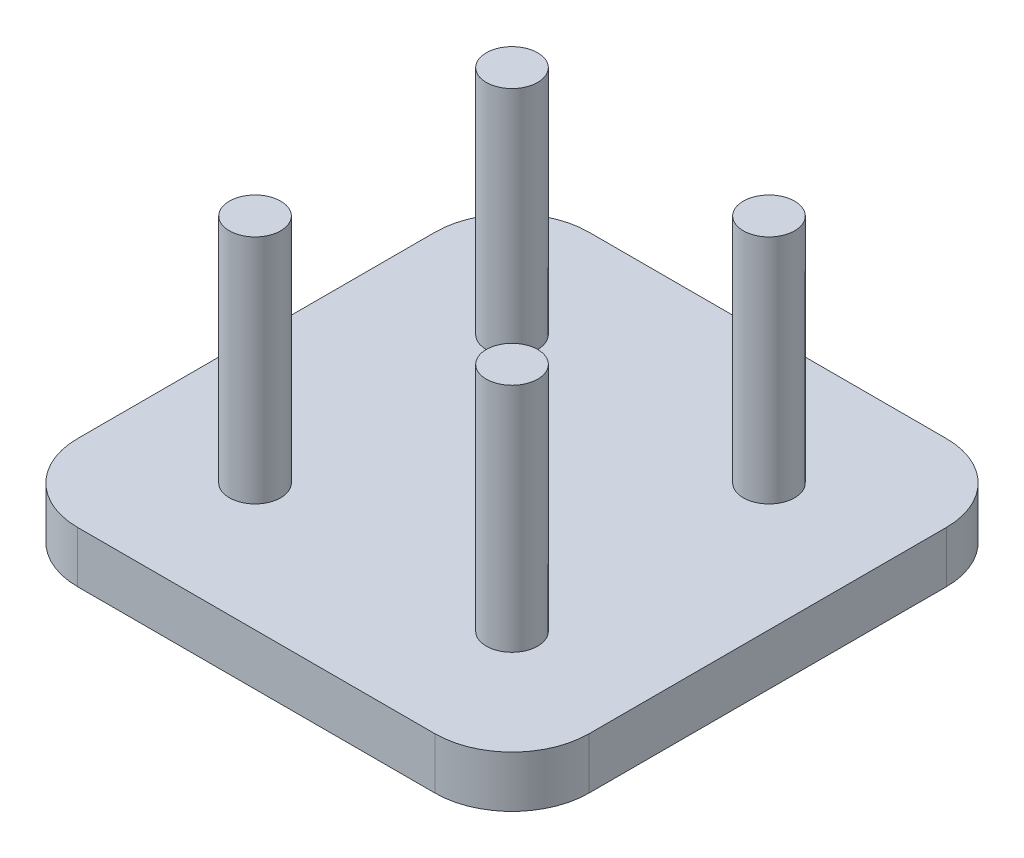
ISO-10303-21;
HEADER;
FILE_DESCRIPTION(('STEP AP214'),'2;1');
FILE_NAME('part.step','',(''),(''),'','','');
FILE_SCHEMA(('AUTOMOTIVE_DESIGN { 1 0 10303 214 1 1 1 1 }'));
ENDSEC;
DATA;
#1=APPLICATION_CONTEXT('core data for automotive mechanical design processes');
#2=APPLICATION_PROTOCOL_DEFINITION('international standard','automotive_design',2000,#1);
#3=PRODUCT_CONTEXT('',#1,'mechanical');
#4=PRODUCT('Part','Part','',(#3));
#5=PRODUCT_RELATED_PRODUCT_CATEGORY('part','',(#4));
#6=PRODUCT_DEFINITION_FORMATION('','',#4);
#7=PRODUCT_DEFINITION_CONTEXT('part definition',#1,'design');
#8=PRODUCT_DEFINITION('design','',#6,#7);
#9=PRODUCT_DEFINITION_SHAPE('','',#8);
#10=(LENGTH_UNIT() NAMED_UNIT(*) SI_UNIT(.MILLI.,.METRE.));
#11=(NAMED_UNIT(*) PLANE_ANGLE_UNIT() SI_UNIT($,.RADIAN.));
#12=(NAMED_UNIT(*) SI_UNIT($,.STERADIAN.) SOLID_ANGLE_UNIT());
#13=UNCERTAINTY_MEASURE_WITH_UNIT(LENGTH_MEASURE(1.E-05),#10,'distance_accuracy_value','');
#14=(GEOMETRIC_REPRESENTATION_CONTEXT(3) GLOBAL_UNCERTAINTY_ASSIGNED_CONTEXT((#13)) GLOBAL_UNIT_ASSIGNED_CONTEXT((#10,
#11,#12)) REPRESENTATION_CONTEXT('',''));
#15=CARTESIAN_POINT('',(0.,0.,0.));
#16=DIRECTION('',(0.,0.,1.));
#17=DIRECTION('',(1.,0.,0.));
#18=AXIS2_PLACEMENT_3D('',#15,#16,#17);
#19=CARTESIAN_POINT('',(19.9,4.,19.9));
#20=DIRECTION('',(-1.,0.,0.));
#21=DIRECTION('',(0.,0.,1.));
#22=AXIS2_PLACEMENT_3D('',#19,#20,#21);
#23=PLANE('',#22);
#24=DIRECTION('',(0.,0.,-1.));
#25=VECTOR('',#24,1.);
#26=CARTESIAN_POINT('',(19.9,4.,19.9));
#27=LINE('',#26,#25);
#28=CARTESIAN_POINT('',(19.9,4.,13.9));
#29=VERTEX_POINT('',#28);
#30=CARTESIAN_POINT('',(19.9,4.,-13.9));
#31=VERTEX_POINT('',#30);
#32=EDGE_CURVE('E132',#29,#31,#27,.T.);
#33=ORIENTED_EDGE('',*,*,#32,.F.);
#34=DIRECTION('',(0.,-1.,0.));
#35=VECTOR('',#34,1.);
#36=CARTESIAN_POINT('',(19.9,4.,13.9));
#37=LINE('',#36,#35);
#38=CARTESIAN_POINT('',(19.9,0.,13.9));
#39=VERTEX_POINT('',#38);
#40=EDGE_CURVE('E117',#29,#39,#37,.T.);
#41=ORIENTED_EDGE('',*,*,#40,.T.);
#42=DIRECTION('',(0.,0.,-1.));
#43=VECTOR('',#42,1.);
#44=CARTESIAN_POINT('',(19.9,0.,19.9));
#45=LINE('',#44,#43);
#46=CARTESIAN_POINT('',(19.9,0.,-13.9));
#47=VERTEX_POINT('',#46);
#48=EDGE_CURVE('E129',#39,#47,#45,.T.);
#49=ORIENTED_EDGE('',*,*,#48,.T.);
#50=DIRECTION('',(0.,-1.,0.));
#51=VECTOR('',#50,1.);
#52=CARTESIAN_POINT('',(19.9,4.,-13.9));
#53=LINE('',#52,#51);
#54=EDGE_CURVE('E134',#47,#31,#53,.F.);
#55=ORIENTED_EDGE('',*,*,#54,.T.);
#56=EDGE_LOOP('',(#33,#41,#49,#55));
#57=FACE_BOUND('',#56,.T.);
#58=ADVANCED_FACE('F46',(#57),#23,.F.);
#59=CARTESIAN_POINT('',(-19.9,4.,-19.9));
#60=DIRECTION('',(0.,0.,1.));
#61=DIRECTION('',(1.,0.,0.));
#62=AXIS2_PLACEMENT_3D('',#59,#60,#61);
#63=PLANE('',#62);
#64=DIRECTION('',(-1.,0.,0.));
#65=VECTOR('',#64,1.);
#66=CARTESIAN_POINT('',(-19.9,0.,-19.9));
#67=LINE('',#66,#65);
#68=CARTESIAN_POINT('',(13.9,0.,-19.9));
#69=VERTEX_POINT('',#68);
#70=CARTESIAN_POINT('',(-13.9,0.,-19.9));
#71=VERTEX_POINT('',#70);
#72=EDGE_CURVE('E139',#69,#71,#67,.T.);
#73=ORIENTED_EDGE('',*,*,#72,.T.);
#74=DIRECTION('',(0.,-1.,0.));
#75=VECTOR('',#74,1.);
#76=CARTESIAN_POINT('',(-13.9,4.,-19.9));
#77=LINE('',#76,#75);
#78=CARTESIAN_POINT('',(-13.9,4.,-19.9));
#79=VERTEX_POINT('',#78);
#80=EDGE_CURVE('E176',#71,#79,#77,.F.);
#81=ORIENTED_EDGE('',*,*,#80,.T.);
#82=DIRECTION('',(-1.,0.,0.));
#83=VECTOR('',#82,1.);
#84=CARTESIAN_POINT('',(-19.9,4.,-19.9));
#85=LINE('',#84,#83);
#86=CARTESIAN_POINT('',(13.9,4.,-19.9));
#87=VERTEX_POINT('',#86);
#88=EDGE_CURVE('E203',#87,#79,#85,.T.);
#89=ORIENTED_EDGE('',*,*,#88,.F.);
#90=DIRECTION('',(0.,-1.,0.));
#91=VECTOR('',#90,1.);
#92=CARTESIAN_POINT('',(13.9,4.,-19.9));
#93=LINE('',#92,#91);
#94=EDGE_CURVE('E173',#87,#69,#93,.T.);
#95=ORIENTED_EDGE('',*,*,#94,.T.);
#96=EDGE_LOOP('',(#73,#81,#89,#95));
#97=FACE_BOUND('',#96,.T.);
#98=ADVANCED_FACE('F228',(#97),#63,.F.);
#99=CARTESIAN_POINT('',(-19.9,4.,19.9));
#100=DIRECTION('',(1.,0.,0.));
#101=DIRECTION('',(0.,0.,-1.));
#102=AXIS2_PLACEMENT_3D('',#99,#100,#101);
#103=PLANE('',#102);
#104=DIRECTION('',(0.,0.,1.));
#105=VECTOR('',#104,1.);
#106=CARTESIAN_POINT('',(-19.9,4.,19.9));
#107=LINE('',#106,#105);
#108=CARTESIAN_POINT('',(-19.9,4.,-13.9));
#109=VERTEX_POINT('',#108);
#110=CARTESIAN_POINT('',(-19.9,4.,13.9));
#111=VERTEX_POINT('',#110);
#112=EDGE_CURVE('E202',#109,#111,#107,.T.);
#113=ORIENTED_EDGE('',*,*,#112,.F.);
#114=DIRECTION('',(0.,-1.,0.));
#115=VECTOR('',#114,1.);
#116=CARTESIAN_POINT('',(-19.9,4.,-13.9));
#117=LINE('',#116,#115);
#118=CARTESIAN_POINT('',(-19.9,0.,-13.9));
#119=VERTEX_POINT('',#118);
#120=EDGE_CURVE('E170',#109,#119,#117,.T.);
#121=ORIENTED_EDGE('',*,*,#120,.T.);
#122=DIRECTION('',(0.,0.,1.));
#123=VECTOR('',#122,1.);
#124=CARTESIAN_POINT('',(-19.9,0.,19.9));
#125=LINE('',#124,#123);
#126=CARTESIAN_POINT('',(-19.9,0.,13.9));
#127=VERTEX_POINT('',#126);
#128=EDGE_CURVE('E143',#119,#127,#125,.T.);
#129=ORIENTED_EDGE('',*,*,#128,.T.);
#130=DIRECTION('',(0.,-1.,0.));
#131=VECTOR('',#130,1.);
#132=CARTESIAN_POINT('',(-19.9,4.,13.9));
#133=LINE('',#132,#131);
#134=EDGE_CURVE('E61',#127,#111,#133,.F.);
#135=ORIENTED_EDGE('',*,*,#134,.T.);
#136=EDGE_LOOP('',(#113,#121,#129,#135));
#137=FACE_BOUND('',#136,.T.);
#138=ADVANCED_FACE('F233',(#137),#103,.F.);
#139=CARTESIAN_POINT('',(-19.9,4.,19.9));
#140=DIRECTION('',(0.,0.,-1.));
#141=DIRECTION('',(-1.,0.,0.));
#142=AXIS2_PLACEMENT_3D('',#139,#140,#141);
#143=PLANE('',#142);
#144=DIRECTION('',(1.,0.,0.));
#145=VECTOR('',#144,1.);
#146=CARTESIAN_POINT('',(-19.9,0.,19.9));
#147=LINE('',#146,#145);
#148=CARTESIAN_POINT('',(-13.9,0.,19.9));
#149=VERTEX_POINT('',#148);
#150=CARTESIAN_POINT('',(13.9,0.,19.9));
#151=VERTEX_POINT('',#150);
#152=EDGE_CURVE('E153',#149,#151,#147,.T.);
#153=ORIENTED_EDGE('',*,*,#152,.T.);
#154=DIRECTION('',(0.,-1.,0.));
#155=VECTOR('',#154,1.);
#156=CARTESIAN_POINT('',(13.9,4.,19.9));
#157=LINE('',#156,#155);
#158=CARTESIAN_POINT('',(13.9,4.,19.9));
#159=VERTEX_POINT('',#158);
#160=EDGE_CURVE('E118',#151,#159,#157,.F.);
#161=ORIENTED_EDGE('',*,*,#160,.T.);
#162=DIRECTION('',(1.,0.,0.));
#163=VECTOR('',#162,1.);
#164=CARTESIAN_POINT('',(-19.9,4.,19.9));
#165=LINE('',#164,#163);
#166=CARTESIAN_POINT('',(-13.9,4.,19.9));
#167=VERTEX_POINT('',#166);
#168=EDGE_CURVE('E149',#167,#159,#165,.T.);
#169=ORIENTED_EDGE('',*,*,#168,.F.);
#170=DIRECTION('',(0.,-1.,0.));
#171=VECTOR('',#170,1.);
#172=CARTESIAN_POINT('',(-13.9,4.,19.9));
#173=LINE('',#172,#171);
#174=EDGE_CURVE('E123',#167,#149,#173,.T.);
#175=ORIENTED_EDGE('',*,*,#174,.T.);
#176=EDGE_LOOP('',(#153,#161,#169,#175));
#177=FACE_BOUND('',#176,.T.);
#178=ADVANCED_FACE('F191',(#177),#143,.F.);
#179=CARTESIAN_POINT('',(0.,4.,0.));
#180=DIRECTION('',(0.,-1.,0.));
#181=DIRECTION('',(0.,0.,-1.));
#182=AXIS2_PLACEMENT_3D('',#179,#180,#181);
#183=PLANE('',#182);
#184=CARTESIAN_POINT('',(-10.,4.,10.));
#185=DIRECTION('',(0.,-1.,0.));
#186=DIRECTION('',(0.,0.,-1.));
#187=AXIS2_PLACEMENT_3D('',#184,#185,#186);
#188=CIRCLE('',#187,2.);
#189=CARTESIAN_POINT('',(-10.,4.,8.));
#190=VERTEX_POINT('',#189);
#191=EDGE_CURVE('E14',#190,#190,#188,.F.);
#192=ORIENTED_EDGE('',*,*,#191,.F.);
#193=EDGE_LOOP('',(#192));
#194=FACE_BOUND('',#193,.T.);
#195=CARTESIAN_POINT('',(10.,4.,10.));
#196=DIRECTION('',(0.,-1.,0.));
#197=DIRECTION('',(0.,0.,-1.));
#198=AXIS2_PLACEMENT_3D('',#195,#196,#197);
#199=CIRCLE('',#198,2.);
#200=CARTESIAN_POINT('',(10.,4.,8.));
#201=VERTEX_POINT('',#200);
#202=EDGE_CURVE('E54',#201,#201,#199,.F.);
#203=ORIENTED_EDGE('',*,*,#202,.F.);
#204=EDGE_LOOP('',(#203));
#205=FACE_BOUND('',#204,.T.);
#206=CARTESIAN_POINT('',(10.,4.,-10.));
#207=DIRECTION('',(0.,-1.,0.));
#208=DIRECTION('',(0.,0.,-1.));
#209=AXIS2_PLACEMENT_3D('',#206,#207,#208);
#210=CIRCLE('',#209,2.);
#211=CARTESIAN_POINT('',(10.,4.,-12.));
#212=VERTEX_POINT('',#211);
#213=EDGE_CURVE('E181',#212,#212,#210,.F.);
#214=ORIENTED_EDGE('',*,*,#213,.F.);
#215=EDGE_LOOP('',(#214));
#216=FACE_BOUND('',#215,.T.);
#217=CARTESIAN_POINT('',(-10.,4.,-10.));
#218=DIRECTION('',(0.,-1.,0.));
#219=DIRECTION('',(0.,0.,-1.));
#220=AXIS2_PLACEMENT_3D('',#217,#218,#219);
#221=CIRCLE('',#220,2.);
#222=CARTESIAN_POINT('',(-10.,4.,-12.));
#223=VERTEX_POINT('',#222);
#224=EDGE_CURVE('E178',#223,#223,#221,.F.);
#225=ORIENTED_EDGE('',*,*,#224,.F.);
#226=EDGE_LOOP('',(#225));
#227=FACE_BOUND('',#226,.T.);
#228=ORIENTED_EDGE('',*,*,#168,.T.);
#229=CARTESIAN_POINT('',(13.9,4.,13.9));
#230=DIRECTION('',(0.,-1.,0.));
#231=DIRECTION('',(0.,0.,-1.));
#232=AXIS2_PLACEMENT_3D('',#229,#230,#231);
#233=CIRCLE('',#232,6.);
#234=EDGE_CURVE('E167',#159,#29,#233,.F.);
#235=ORIENTED_EDGE('',*,*,#234,.T.);
#236=ORIENTED_EDGE('',*,*,#32,.T.);
#237=CARTESIAN_POINT('',(13.9,4.,-13.9));
#238=DIRECTION('',(0.,-1.,0.));
#239=DIRECTION('',(0.,0.,-1.));
#240=AXIS2_PLACEMENT_3D('',#237,#238,#239);
#241=CIRCLE('',#240,6.);
#242=EDGE_CURVE('E164',#31,#87,#241,.F.);
#243=ORIENTED_EDGE('',*,*,#242,.T.);
#244=ORIENTED_EDGE('',*,*,#88,.T.);
#245=CARTESIAN_POINT('',(-13.9,4.,-13.9));
#246=DIRECTION('',(0.,-1.,0.));
#247=DIRECTION('',(0.,0.,-1.));
#248=AXIS2_PLACEMENT_3D('',#245,#246,#247);
#249=CIRCLE('',#248,6.);
#250=EDGE_CURVE('E68',#79,#109,#249,.F.);
#251=ORIENTED_EDGE('',*,*,#250,.T.);
#252=ORIENTED_EDGE('',*,*,#112,.T.);
#253=CARTESIAN_POINT('',(-13.9,4.,13.9));
#254=DIRECTION('',(0.,-1.,0.));
#255=DIRECTION('',(0.,0.,-1.));
#256=AXIS2_PLACEMENT_3D('',#253,#254,#255);
#257=CIRCLE('',#256,6.);
#258=EDGE_CURVE('E162',#111,#167,#257,.F.);
#259=ORIENTED_EDGE('',*,*,#258,.T.);
#260=EDGE_LOOP('',(#228,#235,#236,#243,#244,#251,#252,#259));
#261=FACE_BOUND('',#260,.T.);
#262=ADVANCED_FACE('F188',(#194,#205,#216,#227,#261),#183,.F.);
#263=CARTESIAN_POINT('',(0.,0.,0.));
#264=DIRECTION('',(0.,-1.,0.));
#265=DIRECTION('',(0.,0.,-1.));
#266=AXIS2_PLACEMENT_3D('',#263,#264,#265);
#267=PLANE('',#266);
#268=ORIENTED_EDGE('',*,*,#48,.F.);
#269=CARTESIAN_POINT('',(13.9,0.,13.9));
#270=DIRECTION('',(0.,-1.,0.));
#271=DIRECTION('',(0.,0.,-1.));
#272=AXIS2_PLACEMENT_3D('',#269,#270,#271);
#273=CIRCLE('',#272,6.);
#274=EDGE_CURVE('E113',#39,#151,#273,.T.);
#275=ORIENTED_EDGE('',*,*,#274,.T.);
#276=ORIENTED_EDGE('',*,*,#152,.F.);
#277=CARTESIAN_POINT('',(-13.9,0.,13.9));
#278=DIRECTION('',(0.,-1.,0.));
#279=DIRECTION('',(0.,0.,-1.));
#280=AXIS2_PLACEMENT_3D('',#277,#278,#279);
#281=CIRCLE('',#280,6.);
#282=EDGE_CURVE('E133',#149,#127,#281,.T.);
#283=ORIENTED_EDGE('',*,*,#282,.T.);
#284=ORIENTED_EDGE('',*,*,#128,.F.);
#285=CARTESIAN_POINT('',(-13.9,0.,-13.9));
#286=DIRECTION('',(0.,-1.,0.));
#287=DIRECTION('',(0.,0.,-1.));
#288=AXIS2_PLACEMENT_3D('',#285,#286,#287);
#289=CIRCLE('',#288,6.);
#290=EDGE_CURVE('E124',#119,#71,#289,.T.);
#291=ORIENTED_EDGE('',*,*,#290,.T.);
#292=ORIENTED_EDGE('',*,*,#72,.F.);
#293=CARTESIAN_POINT('',(13.9,0.,-13.9));
#294=DIRECTION('',(0.,-1.,0.));
#295=DIRECTION('',(0.,0.,-1.));
#296=AXIS2_PLACEMENT_3D('',#293,#294,#295);
#297=CIRCLE('',#296,6.);
#298=EDGE_CURVE('E138',#69,#47,#297,.T.);
#299=ORIENTED_EDGE('',*,*,#298,.T.);
#300=EDGE_LOOP('',(#268,#275,#276,#283,#284,#291,#292,#299));
#301=FACE_BOUND('',#300,.T.);
#302=ADVANCED_FACE('F136',(#301),#267,.T.);
#303=CARTESIAN_POINT('',(13.9,4.,13.9));
#304=DIRECTION('',(0.,-1.,0.));
#305=DIRECTION('',(0.,0.,-1.));
#306=AXIS2_PLACEMENT_3D('',#303,#304,#305);
#307=CYLINDRICAL_SURFACE('',#306,6.);
#308=ORIENTED_EDGE('',*,*,#234,.F.);
#309=ORIENTED_EDGE('',*,*,#160,.F.);
#310=ORIENTED_EDGE('',*,*,#274,.F.);
#311=ORIENTED_EDGE('',*,*,#40,.F.);
#312=EDGE_LOOP('',(#308,#309,#310,#311));
#313=FACE_BOUND('',#312,.T.);
#314=ADVANCED_FACE('F116',(#313),#307,.T.);
#315=CARTESIAN_POINT('',(-13.9,4.,-13.9));
#316=DIRECTION('',(0.,-1.,0.));
#317=DIRECTION('',(0.,0.,-1.));
#318=AXIS2_PLACEMENT_3D('',#315,#316,#317);
#319=CYLINDRICAL_SURFACE('',#318,6.);
#320=ORIENTED_EDGE('',*,*,#250,.F.);
#321=ORIENTED_EDGE('',*,*,#80,.F.);
#322=ORIENTED_EDGE('',*,*,#290,.F.);
#323=ORIENTED_EDGE('',*,*,#120,.F.);
#324=EDGE_LOOP('',(#320,#321,#322,#323));
#325=FACE_BOUND('',#324,.T.);
#326=ADVANCED_FACE('F240',(#325),#319,.T.);
#327=CARTESIAN_POINT('',(13.9,4.,-13.9));
#328=DIRECTION('',(0.,-1.,0.));
#329=DIRECTION('',(0.,0.,-1.));
#330=AXIS2_PLACEMENT_3D('',#327,#328,#329);
#331=CYLINDRICAL_SURFACE('',#330,6.);
#332=ORIENTED_EDGE('',*,*,#242,.F.);
#333=ORIENTED_EDGE('',*,*,#54,.F.);
#334=ORIENTED_EDGE('',*,*,#298,.F.);
#335=ORIENTED_EDGE('',*,*,#94,.F.);
#336=EDGE_LOOP('',(#332,#333,#334,#335));
#337=FACE_BOUND('',#336,.T.);
#338=ADVANCED_FACE('F242',(#337),#331,.T.);
#339=CARTESIAN_POINT('',(-13.9,4.,13.9));
#340=DIRECTION('',(0.,-1.,0.));
#341=DIRECTION('',(0.,0.,-1.));
#342=AXIS2_PLACEMENT_3D('',#339,#340,#341);
#343=CYLINDRICAL_SURFACE('',#342,6.);
#344=ORIENTED_EDGE('',*,*,#258,.F.);
#345=ORIENTED_EDGE('',*,*,#134,.F.);
#346=ORIENTED_EDGE('',*,*,#282,.F.);
#347=ORIENTED_EDGE('',*,*,#174,.F.);
#348=EDGE_LOOP('',(#344,#345,#346,#347));
#349=FACE_BOUND('',#348,.T.);
#350=ADVANCED_FACE('F48',(#349),#343,.T.);
#351=CARTESIAN_POINT('',(-10.,49.6568542494924,-10.));
#352=DIRECTION('',(0.,-1.,0.));
#353=DIRECTION('',(0.,0.,-1.));
#354=AXIS2_PLACEMENT_3D('',#351,#352,#353);
#355=CYLINDRICAL_SURFACE('',#354,2.);
#356=CARTESIAN_POINT('',(-10.,22.,-10.));
#357=DIRECTION('',(0.,-1.,0.));
#358=DIRECTION('',(0.,0.,-1.));
#359=AXIS2_PLACEMENT_3D('',#356,#357,#358);
#360=CIRCLE('',#359,2.);
#361=CARTESIAN_POINT('',(-10.,22.,-12.));
#362=VERTEX_POINT('',#361);
#363=EDGE_CURVE('E140',#362,#362,#360,.T.);
#364=ORIENTED_EDGE('',*,*,#363,.T.);
#365=EDGE_LOOP('',(#364));
#366=FACE_BOUND('',#365,.T.);
#367=ORIENTED_EDGE('',*,*,#224,.T.);
#368=EDGE_LOOP('',(#367));
#369=FACE_BOUND('',#368,.T.);
#370=ADVANCED_FACE('F249',(#366,#369),#355,.T.);
#371=CARTESIAN_POINT('',(0.,22.,0.));
#372=DIRECTION('',(0.,-1.,0.));
#373=DIRECTION('',(0.,0.,-1.));
#374=AXIS2_PLACEMENT_3D('',#371,#372,#373);
#375=PLANE('',#374);
#376=ORIENTED_EDGE('',*,*,#363,.F.);
#377=EDGE_LOOP('',(#376));
#378=FACE_BOUND('',#377,.T.);
#379=ADVANCED_FACE('F267',(#378),#375,.F.);
#380=CARTESIAN_POINT('',(10.,49.6568542494924,-10.));
#381=DIRECTION('',(0.,-1.,0.));
#382=DIRECTION('',(0.,0.,-1.));
#383=AXIS2_PLACEMENT_3D('',#380,#381,#382);
#384=CYLINDRICAL_SURFACE('',#383,2.);
#385=CARTESIAN_POINT('',(10.,22.,-10.));
#386=DIRECTION('',(0.,-1.,0.));
#387=DIRECTION('',(0.,0.,-1.));
#388=AXIS2_PLACEMENT_3D('',#385,#386,#387);
#389=CIRCLE('',#388,2.);
#390=CARTESIAN_POINT('',(10.,22.,-12.));
#391=VERTEX_POINT('',#390);
#392=EDGE_CURVE('E146',#391,#391,#389,.T.);
#393=ORIENTED_EDGE('',*,*,#392,.T.);
#394=EDGE_LOOP('',(#393));
#395=FACE_BOUND('',#394,.T.);
#396=ORIENTED_EDGE('',*,*,#213,.T.);
#397=EDGE_LOOP('',(#396));
#398=FACE_BOUND('',#397,.T.);
#399=ADVANCED_FACE('F271',(#395,#398),#384,.T.);
#400=CARTESIAN_POINT('',(0.,22.,0.));
#401=DIRECTION('',(0.,-1.,0.));
#402=DIRECTION('',(0.,0.,-1.));
#403=AXIS2_PLACEMENT_3D('',#400,#401,#402);
#404=PLANE('',#403);
#405=ORIENTED_EDGE('',*,*,#392,.F.);
#406=EDGE_LOOP('',(#405));
#407=FACE_BOUND('',#406,.T.);
#408=ADVANCED_FACE('F275',(#407),#404,.F.);
#409=CARTESIAN_POINT('',(10.,49.6568542494924,10.));
#410=DIRECTION('',(0.,-1.,0.));
#411=DIRECTION('',(0.,0.,-1.));
#412=AXIS2_PLACEMENT_3D('',#409,#410,#411);
#413=CYLINDRICAL_SURFACE('',#412,2.);
#414=CARTESIAN_POINT('',(10.,22.,10.));
#415=DIRECTION('',(0.,-1.,0.));
#416=DIRECTION('',(0.,0.,-1.));
#417=AXIS2_PLACEMENT_3D('',#414,#415,#416);
#418=CIRCLE('',#417,2.);
#419=CARTESIAN_POINT('',(10.,22.,8.));
#420=VERTEX_POINT('',#419);
#421=EDGE_CURVE('E209',#420,#420,#418,.T.);
#422=ORIENTED_EDGE('',*,*,#421,.T.);
#423=EDGE_LOOP('',(#422));
#424=FACE_BOUND('',#423,.T.);
#425=ORIENTED_EDGE('',*,*,#202,.T.);
#426=EDGE_LOOP('',(#425));
#427=FACE_BOUND('',#426,.T.);
#428=ADVANCED_FACE('F186',(#424,#427),#413,.T.);
#429=CARTESIAN_POINT('',(0.,22.,0.));
#430=DIRECTION('',(0.,-1.,0.));
#431=DIRECTION('',(0.,0.,-1.));
#432=AXIS2_PLACEMENT_3D('',#429,#430,#431);
#433=PLANE('',#432);
#434=ORIENTED_EDGE('',*,*,#421,.F.);
#435=EDGE_LOOP('',(#434));
#436=FACE_BOUND('',#435,.T.);
#437=ADVANCED_FACE('F225',(#436),#433,.F.);
#438=CARTESIAN_POINT('',(-10.,49.6568542494924,10.));
#439=DIRECTION('',(0.,-1.,0.));
#440=DIRECTION('',(0.,0.,-1.));
#441=AXIS2_PLACEMENT_3D('',#438,#439,#440);
#442=CYLINDRICAL_SURFACE('',#441,2.);
#443=CARTESIAN_POINT('',(-10.,22.,10.));
#444=DIRECTION('',(0.,-1.,0.));
#445=DIRECTION('',(0.,0.,-1.));
#446=AXIS2_PLACEMENT_3D('',#443,#444,#445);
#447=CIRCLE('',#446,2.);
#448=CARTESIAN_POINT('',(-10.,22.,8.));
#449=VERTEX_POINT('',#448);
#450=EDGE_CURVE('E212',#449,#449,#447,.T.);
#451=ORIENTED_EDGE('',*,*,#450,.T.);
#452=EDGE_LOOP('',(#451));
#453=FACE_BOUND('',#452,.T.);
#454=ORIENTED_EDGE('',*,*,#191,.T.);
#455=EDGE_LOOP('',(#454));
#456=FACE_BOUND('',#455,.T.);
#457=ADVANCED_FACE('F216',(#453,#456),#442,.T.);
#458=CARTESIAN_POINT('',(0.,22.,0.));
#459=DIRECTION('',(0.,-1.,0.));
#460=DIRECTION('',(0.,0.,-1.));
#461=AXIS2_PLACEMENT_3D('',#458,#459,#460);
#462=PLANE('',#461);
#463=ORIENTED_EDGE('',*,*,#450,.F.);
#464=EDGE_LOOP('',(#463));
#465=FACE_BOUND('',#464,.T.);
#466=ADVANCED_FACE('F219',(#465),#462,.F.);
#467=CLOSED_SHELL('',(#58,#98,#138,#178,#262,#302,#314,#326,#338,#350,#370,#379,#399,#408,#428,
#437,#457,#466));
#468=MANIFOLD_SOLID_BREP('B2',#467);
#469=ADVANCED_BREP_SHAPE_REPRESENTATION('',(#18,#468),#14);
#470=SHAPE_DEFINITION_REPRESENTATION(#9,#469);
ENDSEC;
END-ISO-10303-21;
